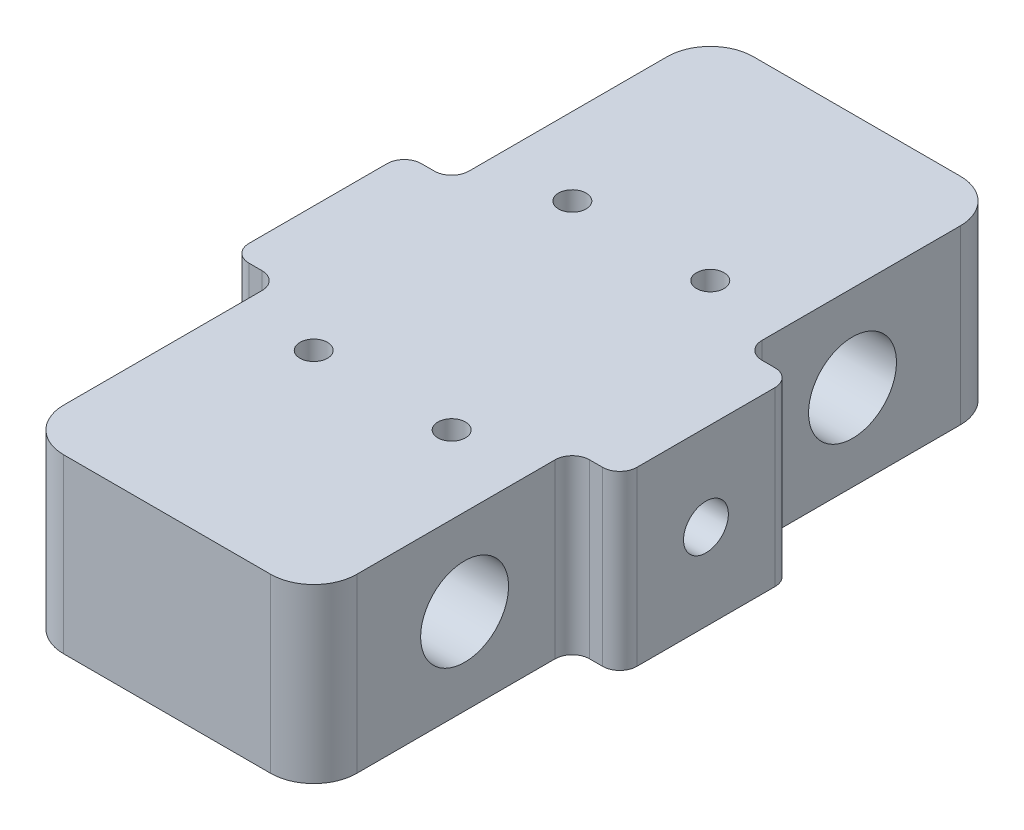
ISO-10303-21;
HEADER;
FILE_DESCRIPTION(('STEP AP214'),'2;1');
FILE_NAME('part.step','',(''),(''),'','','');
FILE_SCHEMA(('AUTOMOTIVE_DESIGN { 1 0 10303 214 1 1 1 1 }'));
ENDSEC;
DATA;
#1=APPLICATION_CONTEXT('core data for automotive mechanical design processes');
#2=APPLICATION_PROTOCOL_DEFINITION('international standard','automotive_design',2000,#1);
#3=PRODUCT_CONTEXT('',#1,'mechanical');
#4=PRODUCT('Part','Part','',(#3));
#5=PRODUCT_RELATED_PRODUCT_CATEGORY('part','',(#4));
#6=PRODUCT_DEFINITION_FORMATION('','',#4);
#7=PRODUCT_DEFINITION_CONTEXT('part definition',#1,'design');
#8=PRODUCT_DEFINITION('design','',#6,#7);
#9=PRODUCT_DEFINITION_SHAPE('','',#8);
#10=(LENGTH_UNIT() NAMED_UNIT(*) SI_UNIT(.MILLI.,.METRE.));
#11=(NAMED_UNIT(*) PLANE_ANGLE_UNIT() SI_UNIT($,.RADIAN.));
#12=(NAMED_UNIT(*) SI_UNIT($,.STERADIAN.) SOLID_ANGLE_UNIT());
#13=UNCERTAINTY_MEASURE_WITH_UNIT(LENGTH_MEASURE(1.E-05),#10,'distance_accuracy_value','');
#14=(GEOMETRIC_REPRESENTATION_CONTEXT(3) GLOBAL_UNCERTAINTY_ASSIGNED_CONTEXT((#13)) GLOBAL_UNIT_ASSIGNED_CONTEXT((#10,
#11,#12)) REPRESENTATION_CONTEXT('',''));
#15=CARTESIAN_POINT('',(0.,0.,0.));
#16=DIRECTION('',(0.,0.,1.));
#17=DIRECTION('',(1.,0.,0.));
#18=AXIS2_PLACEMENT_3D('',#15,#16,#17);
#19=CARTESIAN_POINT('',(0.,20.,0.));
#20=DIRECTION('',(0.,-1.,0.));
#21=DIRECTION('',(0.,0.,-1.));
#22=AXIS2_PLACEMENT_3D('',#19,#20,#21);
#23=PLANE('',#22);
#24=CARTESIAN_POINT('',(7.99999999999996,20.,-15.));
#25=DIRECTION('',(0.,1.,0.));
#26=DIRECTION('',(0.,0.,1.));
#27=AXIS2_PLACEMENT_3D('',#24,#25,#26);
#28=CIRCLE('',#27,1.6);
#29=CARTESIAN_POINT('',(7.99999999999996,20.,-13.4));
#30=VERTEX_POINT('',#29);
#31=EDGE_CURVE('E399',#30,#30,#28,.T.);
#32=ORIENTED_EDGE('',*,*,#31,.F.);
#33=EDGE_LOOP('',(#32));
#34=FACE_BOUND('',#33,.T.);
#35=CARTESIAN_POINT('',(-7.99999999999996,20.,-15.));
#36=DIRECTION('',(0.,1.,0.));
#37=DIRECTION('',(0.,0.,-1.));
#38=AXIS2_PLACEMENT_3D('',#35,#36,#37);
#39=CIRCLE('',#38,1.6);
#40=CARTESIAN_POINT('',(-7.99999999999996,20.,-16.6));
#41=VERTEX_POINT('',#40);
#42=EDGE_CURVE('E393',#41,#41,#39,.T.);
#43=ORIENTED_EDGE('',*,*,#42,.F.);
#44=EDGE_LOOP('',(#43));
#45=FACE_BOUND('',#44,.T.);
#46=CARTESIAN_POINT('',(-7.99999999999996,20.,15.));
#47=DIRECTION('',(0.,1.,0.));
#48=DIRECTION('',(0.,0.,1.));
#49=AXIS2_PLACEMENT_3D('',#46,#47,#48);
#50=CIRCLE('',#49,1.6);
#51=CARTESIAN_POINT('',(-7.99999999999996,20.,16.6));
#52=VERTEX_POINT('',#51);
#53=EDGE_CURVE('E387',#52,#52,#50,.T.);
#54=ORIENTED_EDGE('',*,*,#53,.F.);
#55=EDGE_LOOP('',(#54));
#56=FACE_BOUND('',#55,.T.);
#57=CARTESIAN_POINT('',(7.99999999999997,20.,15.));
#58=DIRECTION('',(0.,1.,0.));
#59=DIRECTION('',(0.,0.,-1.));
#60=AXIS2_PLACEMENT_3D('',#57,#58,#59);
#61=CIRCLE('',#60,1.6);
#62=CARTESIAN_POINT('',(7.99999999999997,20.,13.4));
#63=VERTEX_POINT('',#62);
#64=EDGE_CURVE('E381',#63,#63,#61,.T.);
#65=ORIENTED_EDGE('',*,*,#64,.F.);
#66=EDGE_LOOP('',(#65));
#67=FACE_BOUND('',#66,.T.);
#68=DIRECTION('',(0.,0.,1.));
#69=VECTOR('',#68,1.);
#70=CARTESIAN_POINT('',(17.,20.,-40.));
#71=LINE('',#70,#69);
#72=CARTESIAN_POINT('',(17.,20.,-35.));
#73=VERTEX_POINT('',#72);
#74=CARTESIAN_POINT('',(17.,20.,-12.));
#75=VERTEX_POINT('',#74);
#76=EDGE_CURVE('E783',#73,#75,#71,.T.);
#77=ORIENTED_EDGE('',*,*,#76,.F.);
#78=CARTESIAN_POINT('',(12.,20.,-35.));
#79=DIRECTION('',(0.,-1.,0.));
#80=DIRECTION('',(0.,0.,-1.));
#81=AXIS2_PLACEMENT_3D('',#78,#79,#80);
#82=CIRCLE('',#81,5.);
#83=CARTESIAN_POINT('',(12.,20.,-40.));
#84=VERTEX_POINT('',#83);
#85=EDGE_CURVE('E310',#73,#84,#82,.F.);
#86=ORIENTED_EDGE('',*,*,#85,.T.);
#87=DIRECTION('',(-1.,0.,0.));
#88=VECTOR('',#87,1.);
#89=CARTESIAN_POINT('',(-22.5,20.,-40.));
#90=LINE('',#89,#88);
#91=CARTESIAN_POINT('',(-12.,20.,-40.));
#92=VERTEX_POINT('',#91);
#93=EDGE_CURVE('E408',#84,#92,#90,.T.);
#94=ORIENTED_EDGE('',*,*,#93,.T.);
#95=CARTESIAN_POINT('',(-12.,20.,-35.));
#96=DIRECTION('',(0.,-1.,0.));
#97=DIRECTION('',(0.,0.,-1.));
#98=AXIS2_PLACEMENT_3D('',#95,#96,#97);
#99=CIRCLE('',#98,5.);
#100=CARTESIAN_POINT('',(-17.,20.,-35.));
#101=VERTEX_POINT('',#100);
#102=EDGE_CURVE('E308',#92,#101,#99,.F.);
#103=ORIENTED_EDGE('',*,*,#102,.T.);
#104=DIRECTION('',(0.,0.,1.));
#105=VECTOR('',#104,1.);
#106=CARTESIAN_POINT('',(-17.,20.,-40.));
#107=LINE('',#106,#105);
#108=CARTESIAN_POINT('',(-17.,20.,-12.));
#109=VERTEX_POINT('',#108);
#110=EDGE_CURVE('E777',#101,#109,#107,.T.);
#111=ORIENTED_EDGE('',*,*,#110,.T.);
#112=CARTESIAN_POINT('',(-19.,20.,-12.));
#113=DIRECTION('',(0.,-1.,0.));
#114=DIRECTION('',(0.,0.,-1.));
#115=AXIS2_PLACEMENT_3D('',#112,#113,#114);
#116=CIRCLE('',#115,2.);
#117=CARTESIAN_POINT('',(-19.,20.,-10.));
#118=VERTEX_POINT('',#117);
#119=EDGE_CURVE('E294',#109,#118,#116,.T.);
#120=ORIENTED_EDGE('',*,*,#119,.T.);
#121=DIRECTION('',(-1.,0.,0.));
#122=VECTOR('',#121,1.);
#123=CARTESIAN_POINT('',(-17.,20.,-10.));
#124=LINE('',#123,#122);
#125=CARTESIAN_POINT('',(-20.5,20.,-10.));
#126=VERTEX_POINT('',#125);
#127=EDGE_CURVE('E776',#118,#126,#124,.T.);
#128=ORIENTED_EDGE('',*,*,#127,.T.);
#129=CARTESIAN_POINT('',(-20.5,20.,-8.));
#130=DIRECTION('',(0.,-1.,0.));
#131=DIRECTION('',(0.,0.,-1.));
#132=AXIS2_PLACEMENT_3D('',#129,#130,#131);
#133=CIRCLE('',#132,2.);
#134=CARTESIAN_POINT('',(-22.5,20.,-8.));
#135=VERTEX_POINT('',#134);
#136=EDGE_CURVE('E251',#126,#135,#133,.F.);
#137=ORIENTED_EDGE('',*,*,#136,.T.);
#138=DIRECTION('',(0.,0.,1.));
#139=VECTOR('',#138,1.);
#140=CARTESIAN_POINT('',(-22.5,20.,40.));
#141=LINE('',#140,#139);
#142=CARTESIAN_POINT('',(-22.5,20.,8.));
#143=VERTEX_POINT('',#142);
#144=EDGE_CURVE('E231',#135,#143,#141,.T.);
#145=ORIENTED_EDGE('',*,*,#144,.T.);
#146=CARTESIAN_POINT('',(-20.5,20.,8.));
#147=DIRECTION('',(0.,-1.,0.));
#148=DIRECTION('',(0.,0.,-1.));
#149=AXIS2_PLACEMENT_3D('',#146,#147,#148);
#150=CIRCLE('',#149,2.);
#151=CARTESIAN_POINT('',(-20.5,20.,10.));
#152=VERTEX_POINT('',#151);
#153=EDGE_CURVE('E249',#143,#152,#150,.F.);
#154=ORIENTED_EDGE('',*,*,#153,.T.);
#155=DIRECTION('',(-1.,0.,0.));
#156=VECTOR('',#155,1.);
#157=CARTESIAN_POINT('',(-17.,20.,10.));
#158=LINE('',#157,#156);
#159=CARTESIAN_POINT('',(-19.,20.,10.));
#160=VERTEX_POINT('',#159);
#161=EDGE_CURVE('E362',#160,#152,#158,.T.);
#162=ORIENTED_EDGE('',*,*,#161,.F.);
#163=CARTESIAN_POINT('',(-19.,20.,12.));
#164=DIRECTION('',(0.,-1.,0.));
#165=DIRECTION('',(0.,0.,-1.));
#166=AXIS2_PLACEMENT_3D('',#163,#164,#165);
#167=CIRCLE('',#166,2.);
#168=CARTESIAN_POINT('',(-17.,20.,12.));
#169=VERTEX_POINT('',#168);
#170=EDGE_CURVE('E298',#160,#169,#167,.T.);
#171=ORIENTED_EDGE('',*,*,#170,.T.);
#172=DIRECTION('',(0.,0.,-1.));
#173=VECTOR('',#172,1.);
#174=CARTESIAN_POINT('',(-17.,20.,40.));
#175=LINE('',#174,#173);
#176=CARTESIAN_POINT('',(-17.,20.,35.));
#177=VERTEX_POINT('',#176);
#178=EDGE_CURVE('E354',#177,#169,#175,.T.);
#179=ORIENTED_EDGE('',*,*,#178,.F.);
#180=CARTESIAN_POINT('',(-12.,20.,35.));
#181=DIRECTION('',(0.,-1.,0.));
#182=DIRECTION('',(0.,0.,-1.));
#183=AXIS2_PLACEMENT_3D('',#180,#181,#182);
#184=CIRCLE('',#183,5.);
#185=CARTESIAN_POINT('',(-12.,20.,40.));
#186=VERTEX_POINT('',#185);
#187=EDGE_CURVE('E304',#177,#186,#184,.F.);
#188=ORIENTED_EDGE('',*,*,#187,.T.);
#189=DIRECTION('',(1.,0.,0.));
#190=VECTOR('',#189,1.);
#191=CARTESIAN_POINT('',(-22.5,20.,40.));
#192=LINE('',#191,#190);
#193=CARTESIAN_POINT('',(12.,20.,40.));
#194=VERTEX_POINT('',#193);
#195=EDGE_CURVE('E226',#186,#194,#192,.T.);
#196=ORIENTED_EDGE('',*,*,#195,.T.);
#197=CARTESIAN_POINT('',(12.,20.,35.));
#198=DIRECTION('',(0.,-1.,0.));
#199=DIRECTION('',(0.,0.,-1.));
#200=AXIS2_PLACEMENT_3D('',#197,#198,#199);
#201=CIRCLE('',#200,5.);
#202=CARTESIAN_POINT('',(17.,20.,35.));
#203=VERTEX_POINT('',#202);
#204=EDGE_CURVE('E306',#194,#203,#201,.F.);
#205=ORIENTED_EDGE('',*,*,#204,.T.);
#206=DIRECTION('',(0.,0.,-1.));
#207=VECTOR('',#206,1.);
#208=CARTESIAN_POINT('',(17.,20.,40.));
#209=LINE('',#208,#207);
#210=CARTESIAN_POINT('',(17.,20.,12.));
#211=VERTEX_POINT('',#210);
#212=EDGE_CURVE('E338',#203,#211,#209,.T.);
#213=ORIENTED_EDGE('',*,*,#212,.T.);
#214=CARTESIAN_POINT('',(19.,20.,12.));
#215=DIRECTION('',(0.,-1.,0.));
#216=DIRECTION('',(0.,0.,-1.));
#217=AXIS2_PLACEMENT_3D('',#214,#215,#216);
#218=CIRCLE('',#217,2.);
#219=CARTESIAN_POINT('',(19.,20.,10.));
#220=VERTEX_POINT('',#219);
#221=EDGE_CURVE('E290',#211,#220,#218,.T.);
#222=ORIENTED_EDGE('',*,*,#221,.T.);
#223=DIRECTION('',(1.,0.,0.));
#224=VECTOR('',#223,1.);
#225=CARTESIAN_POINT('',(17.,20.,10.));
#226=LINE('',#225,#224);
#227=CARTESIAN_POINT('',(20.5,20.,10.));
#228=VERTEX_POINT('',#227);
#229=EDGE_CURVE('E425',#220,#228,#226,.T.);
#230=ORIENTED_EDGE('',*,*,#229,.T.);
#231=CARTESIAN_POINT('',(20.5,20.,8.));
#232=DIRECTION('',(0.,-1.,0.));
#233=DIRECTION('',(0.,0.,-1.));
#234=AXIS2_PLACEMENT_3D('',#231,#232,#233);
#235=CIRCLE('',#234,2.);
#236=CARTESIAN_POINT('',(22.5,20.,8.));
#237=VERTEX_POINT('',#236);
#238=EDGE_CURVE('E253',#228,#237,#235,.F.);
#239=ORIENTED_EDGE('',*,*,#238,.T.);
#240=DIRECTION('',(0.,0.,-1.));
#241=VECTOR('',#240,1.);
#242=CARTESIAN_POINT('',(22.5,20.,40.));
#243=LINE('',#242,#241);
#244=CARTESIAN_POINT('',(22.5,20.,-8.));
#245=VERTEX_POINT('',#244);
#246=EDGE_CURVE('E405',#237,#245,#243,.T.);
#247=ORIENTED_EDGE('',*,*,#246,.T.);
#248=CARTESIAN_POINT('',(20.5,20.,-8.));
#249=DIRECTION('',(0.,-1.,0.));
#250=DIRECTION('',(0.,0.,-1.));
#251=AXIS2_PLACEMENT_3D('',#248,#249,#250);
#252=CIRCLE('',#251,2.);
#253=CARTESIAN_POINT('',(20.5,20.,-10.));
#254=VERTEX_POINT('',#253);
#255=EDGE_CURVE('E255',#245,#254,#252,.F.);
#256=ORIENTED_EDGE('',*,*,#255,.T.);
#257=DIRECTION('',(1.,0.,0.));
#258=VECTOR('',#257,1.);
#259=CARTESIAN_POINT('',(17.,20.,-10.));
#260=LINE('',#259,#258);
#261=CARTESIAN_POINT('',(19.,20.,-10.));
#262=VERTEX_POINT('',#261);
#263=EDGE_CURVE('E221',#262,#254,#260,.T.);
#264=ORIENTED_EDGE('',*,*,#263,.F.);
#265=CARTESIAN_POINT('',(19.,20.,-12.));
#266=DIRECTION('',(0.,-1.,0.));
#267=DIRECTION('',(0.,0.,-1.));
#268=AXIS2_PLACEMENT_3D('',#265,#266,#267);
#269=CIRCLE('',#268,2.);
#270=EDGE_CURVE('E209',#262,#75,#269,.T.);
#271=ORIENTED_EDGE('',*,*,#270,.T.);
#272=EDGE_LOOP('',(#77,#86,#94,#103,#111,#120,#128,#137,#145,#154,#162,#171,#179,#188,#196,#205,
#213,#222,#230,#239,#247,#256,#264,#271));
#273=FACE_BOUND('',#272,.T.);
#274=ADVANCED_FACE('F34',(#34,#45,#56,#67,#273),#23,.F.);
#275=CARTESIAN_POINT('',(0.,0.,0.));
#276=DIRECTION('',(0.,-1.,0.));
#277=DIRECTION('',(0.,0.,-1.));
#278=AXIS2_PLACEMENT_3D('',#275,#276,#277);
#279=PLANE('',#278);
#280=CARTESIAN_POINT('',(-7.99999999999996,0.,15.));
#281=DIRECTION('',(0.,1.,0.));
#282=DIRECTION('',(0.,0.,1.));
#283=AXIS2_PLACEMENT_3D('',#280,#281,#282);
#284=CIRCLE('',#283,1.6);
#285=CARTESIAN_POINT('',(-7.99999999999996,0.,16.6));
#286=VERTEX_POINT('',#285);
#287=EDGE_CURVE('E384',#286,#286,#284,.T.);
#288=ORIENTED_EDGE('',*,*,#287,.T.);
#289=EDGE_LOOP('',(#288));
#290=FACE_BOUND('',#289,.T.);
#291=CARTESIAN_POINT('',(7.99999999999996,0.,-15.));
#292=DIRECTION('',(0.,1.,0.));
#293=DIRECTION('',(0.,0.,1.));
#294=AXIS2_PLACEMENT_3D('',#291,#292,#293);
#295=CIRCLE('',#294,1.6);
#296=CARTESIAN_POINT('',(7.99999999999996,0.,-13.4));
#297=VERTEX_POINT('',#296);
#298=EDGE_CURVE('E396',#297,#297,#295,.T.);
#299=ORIENTED_EDGE('',*,*,#298,.T.);
#300=EDGE_LOOP('',(#299));
#301=FACE_BOUND('',#300,.T.);
#302=CARTESIAN_POINT('',(-7.99999999999996,0.,-15.));
#303=DIRECTION('',(0.,1.,0.));
#304=DIRECTION('',(0.,0.,-1.));
#305=AXIS2_PLACEMENT_3D('',#302,#303,#304);
#306=CIRCLE('',#305,1.6);
#307=CARTESIAN_POINT('',(-7.99999999999996,0.,-16.6));
#308=VERTEX_POINT('',#307);
#309=EDGE_CURVE('E390',#308,#308,#306,.T.);
#310=ORIENTED_EDGE('',*,*,#309,.T.);
#311=EDGE_LOOP('',(#310));
#312=FACE_BOUND('',#311,.T.);
#313=CARTESIAN_POINT('',(7.99999999999997,0.,15.));
#314=DIRECTION('',(0.,1.,0.));
#315=DIRECTION('',(0.,0.,-1.));
#316=AXIS2_PLACEMENT_3D('',#313,#314,#315);
#317=CIRCLE('',#316,1.6);
#318=CARTESIAN_POINT('',(7.99999999999997,0.,13.4));
#319=VERTEX_POINT('',#318);
#320=EDGE_CURVE('E377',#319,#319,#317,.T.);
#321=ORIENTED_EDGE('',*,*,#320,.T.);
#322=EDGE_LOOP('',(#321));
#323=FACE_BOUND('',#322,.T.);
#324=DIRECTION('',(-1.,0.,0.));
#325=VECTOR('',#324,1.);
#326=CARTESIAN_POINT('',(-22.5,0.,-40.));
#327=LINE('',#326,#325);
#328=CARTESIAN_POINT('',(12.,0.,-40.));
#329=VERTEX_POINT('',#328);
#330=CARTESIAN_POINT('',(-12.,0.,-40.));
#331=VERTEX_POINT('',#330);
#332=EDGE_CURVE('E415',#329,#331,#327,.T.);
#333=ORIENTED_EDGE('',*,*,#332,.F.);
#334=CARTESIAN_POINT('',(12.,0.,-35.));
#335=DIRECTION('',(0.,-1.,0.));
#336=DIRECTION('',(0.,0.,-1.));
#337=AXIS2_PLACEMENT_3D('',#334,#335,#336);
#338=CIRCLE('',#337,5.);
#339=CARTESIAN_POINT('',(17.,0.,-35.));
#340=VERTEX_POINT('',#339);
#341=EDGE_CURVE('E322',#329,#340,#338,.T.);
#342=ORIENTED_EDGE('',*,*,#341,.T.);
#343=DIRECTION('',(0.,0.,-1.));
#344=VECTOR('',#343,1.);
#345=CARTESIAN_POINT('',(17.,0.,-40.));
#346=LINE('',#345,#344);
#347=CARTESIAN_POINT('',(17.,0.,-12.));
#348=VERTEX_POINT('',#347);
#349=EDGE_CURVE('E204',#348,#340,#346,.T.);
#350=ORIENTED_EDGE('',*,*,#349,.F.);
#351=CARTESIAN_POINT('',(19.,0.,-12.));
#352=DIRECTION('',(0.,-1.,0.));
#353=DIRECTION('',(0.,0.,-1.));
#354=AXIS2_PLACEMENT_3D('',#351,#352,#353);
#355=CIRCLE('',#354,2.);
#356=CARTESIAN_POINT('',(19.,0.,-10.));
#357=VERTEX_POINT('',#356);
#358=EDGE_CURVE('E198',#348,#357,#355,.F.);
#359=ORIENTED_EDGE('',*,*,#358,.T.);
#360=DIRECTION('',(1.,0.,0.));
#361=VECTOR('',#360,1.);
#362=CARTESIAN_POINT('',(17.,0.,-10.));
#363=LINE('',#362,#361);
#364=CARTESIAN_POINT('',(20.5,0.,-10.));
#365=VERTEX_POINT('',#364);
#366=EDGE_CURVE('E202',#357,#365,#363,.T.);
#367=ORIENTED_EDGE('',*,*,#366,.T.);
#368=CARTESIAN_POINT('',(20.5,0.,-8.));
#369=DIRECTION('',(0.,-1.,0.));
#370=DIRECTION('',(0.,0.,-1.));
#371=AXIS2_PLACEMENT_3D('',#368,#369,#370);
#372=CIRCLE('',#371,2.);
#373=CARTESIAN_POINT('',(22.5,0.,-8.));
#374=VERTEX_POINT('',#373);
#375=EDGE_CURVE('E242',#365,#374,#372,.T.);
#376=ORIENTED_EDGE('',*,*,#375,.T.);
#377=DIRECTION('',(0.,0.,-1.));
#378=VECTOR('',#377,1.);
#379=CARTESIAN_POINT('',(22.5,0.,40.));
#380=LINE('',#379,#378);
#381=CARTESIAN_POINT('',(22.5,0.,8.));
#382=VERTEX_POINT('',#381);
#383=EDGE_CURVE('E402',#382,#374,#380,.T.);
#384=ORIENTED_EDGE('',*,*,#383,.F.);
#385=CARTESIAN_POINT('',(20.5,0.,8.));
#386=DIRECTION('',(0.,-1.,0.));
#387=DIRECTION('',(0.,0.,-1.));
#388=AXIS2_PLACEMENT_3D('',#385,#386,#387);
#389=CIRCLE('',#388,2.);
#390=CARTESIAN_POINT('',(20.5,0.,10.));
#391=VERTEX_POINT('',#390);
#392=EDGE_CURVE('E240',#382,#391,#389,.T.);
#393=ORIENTED_EDGE('',*,*,#392,.T.);
#394=DIRECTION('',(1.,0.,0.));
#395=VECTOR('',#394,1.);
#396=CARTESIAN_POINT('',(17.,0.,10.));
#397=LINE('',#396,#395);
#398=CARTESIAN_POINT('',(19.,0.,10.));
#399=VERTEX_POINT('',#398);
#400=EDGE_CURVE('E788',#399,#391,#397,.T.);
#401=ORIENTED_EDGE('',*,*,#400,.F.);
#402=CARTESIAN_POINT('',(19.,0.,12.));
#403=DIRECTION('',(0.,-1.,0.));
#404=DIRECTION('',(0.,0.,-1.));
#405=AXIS2_PLACEMENT_3D('',#402,#403,#404);
#406=CIRCLE('',#405,2.);
#407=CARTESIAN_POINT('',(17.,0.,12.));
#408=VERTEX_POINT('',#407);
#409=EDGE_CURVE('E288',#399,#408,#406,.F.);
#410=ORIENTED_EDGE('',*,*,#409,.T.);
#411=DIRECTION('',(0.,0.,1.));
#412=VECTOR('',#411,1.);
#413=CARTESIAN_POINT('',(17.,0.,40.));
#414=LINE('',#413,#412);
#415=CARTESIAN_POINT('',(17.,0.,35.));
#416=VERTEX_POINT('',#415);
#417=EDGE_CURVE('E336',#408,#416,#414,.T.);
#418=ORIENTED_EDGE('',*,*,#417,.T.);
#419=CARTESIAN_POINT('',(12.,0.,35.));
#420=DIRECTION('',(0.,-1.,0.));
#421=DIRECTION('',(0.,0.,-1.));
#422=AXIS2_PLACEMENT_3D('',#419,#420,#421);
#423=CIRCLE('',#422,5.);
#424=CARTESIAN_POINT('',(12.,0.,40.));
#425=VERTEX_POINT('',#424);
#426=EDGE_CURVE('E318',#416,#425,#423,.T.);
#427=ORIENTED_EDGE('',*,*,#426,.T.);
#428=DIRECTION('',(1.,0.,0.));
#429=VECTOR('',#428,1.);
#430=CARTESIAN_POINT('',(-22.5,0.,40.));
#431=LINE('',#430,#429);
#432=CARTESIAN_POINT('',(-12.,0.,40.));
#433=VERTEX_POINT('',#432);
#434=EDGE_CURVE('E350',#433,#425,#431,.T.);
#435=ORIENTED_EDGE('',*,*,#434,.F.);
#436=CARTESIAN_POINT('',(-12.,0.,35.));
#437=DIRECTION('',(0.,-1.,0.));
#438=DIRECTION('',(0.,0.,-1.));
#439=AXIS2_PLACEMENT_3D('',#436,#437,#438);
#440=CIRCLE('',#439,5.);
#441=CARTESIAN_POINT('',(-17.,0.,35.));
#442=VERTEX_POINT('',#441);
#443=EDGE_CURVE('E57',#433,#442,#440,.T.);
#444=ORIENTED_EDGE('',*,*,#443,.T.);
#445=DIRECTION('',(0.,0.,1.));
#446=VECTOR('',#445,1.);
#447=CARTESIAN_POINT('',(-17.,0.,40.));
#448=LINE('',#447,#446);
#449=CARTESIAN_POINT('',(-17.,0.,12.));
#450=VERTEX_POINT('',#449);
#451=EDGE_CURVE('E360',#450,#442,#448,.T.);
#452=ORIENTED_EDGE('',*,*,#451,.F.);
#453=CARTESIAN_POINT('',(-19.,0.,12.));
#454=DIRECTION('',(0.,-1.,0.));
#455=DIRECTION('',(0.,0.,-1.));
#456=AXIS2_PLACEMENT_3D('',#453,#454,#455);
#457=CIRCLE('',#456,2.);
#458=CARTESIAN_POINT('',(-19.,0.,10.));
#459=VERTEX_POINT('',#458);
#460=EDGE_CURVE('E296',#450,#459,#457,.F.);
#461=ORIENTED_EDGE('',*,*,#460,.T.);
#462=DIRECTION('',(-1.,0.,0.));
#463=VECTOR('',#462,1.);
#464=CARTESIAN_POINT('',(-17.,0.,10.));
#465=LINE('',#464,#463);
#466=CARTESIAN_POINT('',(-20.5,0.,10.));
#467=VERTEX_POINT('',#466);
#468=EDGE_CURVE('E365',#459,#467,#465,.T.);
#469=ORIENTED_EDGE('',*,*,#468,.T.);
#470=CARTESIAN_POINT('',(-20.5,0.,8.));
#471=DIRECTION('',(0.,-1.,0.));
#472=DIRECTION('',(0.,0.,-1.));
#473=AXIS2_PLACEMENT_3D('',#470,#471,#472);
#474=CIRCLE('',#473,2.);
#475=CARTESIAN_POINT('',(-22.5,0.,8.));
#476=VERTEX_POINT('',#475);
#477=EDGE_CURVE('E228',#467,#476,#474,.T.);
#478=ORIENTED_EDGE('',*,*,#477,.T.);
#479=DIRECTION('',(0.,0.,1.));
#480=VECTOR('',#479,1.);
#481=CARTESIAN_POINT('',(-22.5,0.,40.));
#482=LINE('',#481,#480);
#483=CARTESIAN_POINT('',(-22.5,0.,-8.));
#484=VERTEX_POINT('',#483);
#485=EDGE_CURVE('E418',#484,#476,#482,.T.);
#486=ORIENTED_EDGE('',*,*,#485,.F.);
#487=CARTESIAN_POINT('',(-20.5,0.,-8.));
#488=DIRECTION('',(0.,-1.,0.));
#489=DIRECTION('',(0.,0.,-1.));
#490=AXIS2_PLACEMENT_3D('',#487,#488,#489);
#491=CIRCLE('',#490,2.);
#492=CARTESIAN_POINT('',(-20.5,0.,-10.));
#493=VERTEX_POINT('',#492);
#494=EDGE_CURVE('E238',#484,#493,#491,.T.);
#495=ORIENTED_EDGE('',*,*,#494,.T.);
#496=DIRECTION('',(-1.,0.,0.));
#497=VECTOR('',#496,1.);
#498=CARTESIAN_POINT('',(-17.,0.,-10.));
#499=LINE('',#498,#497);
#500=CARTESIAN_POINT('',(-19.,0.,-10.));
#501=VERTEX_POINT('',#500);
#502=EDGE_CURVE('E772',#501,#493,#499,.T.);
#503=ORIENTED_EDGE('',*,*,#502,.F.);
#504=CARTESIAN_POINT('',(-19.,0.,-12.));
#505=DIRECTION('',(0.,-1.,0.));
#506=DIRECTION('',(0.,0.,-1.));
#507=AXIS2_PLACEMENT_3D('',#504,#505,#506);
#508=CIRCLE('',#507,2.);
#509=CARTESIAN_POINT('',(-17.,0.,-12.));
#510=VERTEX_POINT('',#509);
#511=EDGE_CURVE('E292',#501,#510,#508,.F.);
#512=ORIENTED_EDGE('',*,*,#511,.T.);
#513=DIRECTION('',(0.,0.,-1.));
#514=VECTOR('',#513,1.);
#515=CARTESIAN_POINT('',(-17.,0.,-40.));
#516=LINE('',#515,#514);
#517=CARTESIAN_POINT('',(-17.,0.,-35.));
#518=VERTEX_POINT('',#517);
#519=EDGE_CURVE('E780',#510,#518,#516,.T.);
#520=ORIENTED_EDGE('',*,*,#519,.T.);
#521=CARTESIAN_POINT('',(-12.,0.,-35.));
#522=DIRECTION('',(0.,-1.,0.));
#523=DIRECTION('',(0.,0.,-1.));
#524=AXIS2_PLACEMENT_3D('',#521,#522,#523);
#525=CIRCLE('',#524,5.);
#526=EDGE_CURVE('E320',#518,#331,#525,.T.);
#527=ORIENTED_EDGE('',*,*,#526,.T.);
#528=EDGE_LOOP('',(#333,#342,#350,#359,#367,#376,#384,#393,#401,#410,#418,#427,#435,#444,#452,
#461,#469,#478,#486,#495,#503,#512,#520,#527));
#529=FACE_BOUND('',#528,.T.);
#530=ADVANCED_FACE('F201',(#290,#301,#312,#323,#529),#279,.T.);
#531=CARTESIAN_POINT('',(-22.5,20.,40.));
#532=DIRECTION('',(1.,0.,0.));
#533=DIRECTION('',(0.,0.,-1.));
#534=AXIS2_PLACEMENT_3D('',#531,#532,#533);
#535=PLANE('',#534);
#536=CARTESIAN_POINT('',(-22.5,10.,0.));
#537=DIRECTION('',(-1.,0.,0.));
#538=DIRECTION('',(0.,0.,1.));
#539=AXIS2_PLACEMENT_3D('',#536,#537,#538);
#540=CIRCLE('',#539,2.6);
#541=CARTESIAN_POINT('',(-22.5,10.,2.6));
#542=VERTEX_POINT('',#541);
#543=EDGE_CURVE('E378',#542,#542,#540,.T.);
#544=ORIENTED_EDGE('',*,*,#543,.F.);
#545=EDGE_LOOP('',(#544));
#546=FACE_BOUND('',#545,.T.);
#547=ORIENTED_EDGE('',*,*,#144,.F.);
#548=DIRECTION('',(0.,-1.,0.));
#549=VECTOR('',#548,1.);
#550=CARTESIAN_POINT('',(-22.5,0.,-8.));
#551=LINE('',#550,#549);
#552=EDGE_CURVE('E277',#135,#484,#551,.T.);
#553=ORIENTED_EDGE('',*,*,#552,.T.);
#554=ORIENTED_EDGE('',*,*,#485,.T.);
#555=DIRECTION('',(0.,-1.,0.));
#556=VECTOR('',#555,1.);
#557=CARTESIAN_POINT('',(-22.5,20.,8.));
#558=LINE('',#557,#556);
#559=EDGE_CURVE('E275',#476,#143,#558,.F.);
#560=ORIENTED_EDGE('',*,*,#559,.T.);
#561=EDGE_LOOP('',(#547,#553,#554,#560));
#562=FACE_BOUND('',#561,.T.);
#563=ADVANCED_FACE('F451',(#546,#562),#535,.F.);
#564=CARTESIAN_POINT('',(22.5,20.,40.));
#565=DIRECTION('',(-1.,0.,0.));
#566=DIRECTION('',(0.,0.,1.));
#567=AXIS2_PLACEMENT_3D('',#564,#565,#566);
#568=PLANE('',#567);
#569=CARTESIAN_POINT('',(22.5,10.,0.));
#570=DIRECTION('',(-1.,0.,0.));
#571=DIRECTION('',(0.,0.,1.));
#572=AXIS2_PLACEMENT_3D('',#569,#570,#571);
#573=CIRCLE('',#572,2.6);
#574=CARTESIAN_POINT('',(22.5,10.,2.6));
#575=VERTEX_POINT('',#574);
#576=EDGE_CURVE('E374',#575,#575,#573,.T.);
#577=ORIENTED_EDGE('',*,*,#576,.T.);
#578=EDGE_LOOP('',(#577));
#579=FACE_BOUND('',#578,.T.);
#580=ORIENTED_EDGE('',*,*,#383,.T.);
#581=DIRECTION('',(0.,-1.,0.));
#582=VECTOR('',#581,1.);
#583=CARTESIAN_POINT('',(22.5,20.,-8.));
#584=LINE('',#583,#582);
#585=EDGE_CURVE('E247',#374,#245,#584,.F.);
#586=ORIENTED_EDGE('',*,*,#585,.T.);
#587=ORIENTED_EDGE('',*,*,#246,.F.);
#588=DIRECTION('',(0.,-1.,0.));
#589=VECTOR('',#588,1.);
#590=CARTESIAN_POINT('',(22.5,0.,8.));
#591=LINE('',#590,#589);
#592=EDGE_CURVE('E244',#237,#382,#591,.T.);
#593=ORIENTED_EDGE('',*,*,#592,.T.);
#594=EDGE_LOOP('',(#580,#586,#587,#593));
#595=FACE_BOUND('',#594,.T.);
#596=ADVANCED_FACE('F465',(#579,#595),#568,.F.);
#597=CARTESIAN_POINT('',(-22.5,20.,-40.));
#598=DIRECTION('',(0.,0.,1.));
#599=DIRECTION('',(1.,0.,0.));
#600=AXIS2_PLACEMENT_3D('',#597,#598,#599);
#601=PLANE('',#600);
#602=ORIENTED_EDGE('',*,*,#93,.F.);
#603=DIRECTION('',(0.,1.,0.));
#604=VECTOR('',#603,1.);
#605=CARTESIAN_POINT('',(12.,20.,-40.));
#606=LINE('',#605,#604);
#607=EDGE_CURVE('E315',#84,#329,#606,.F.);
#608=ORIENTED_EDGE('',*,*,#607,.T.);
#609=ORIENTED_EDGE('',*,*,#332,.T.);
#610=DIRECTION('',(0.,1.,0.));
#611=VECTOR('',#610,1.);
#612=CARTESIAN_POINT('',(-12.,20.,-40.));
#613=LINE('',#612,#611);
#614=EDGE_CURVE('E312',#331,#92,#613,.T.);
#615=ORIENTED_EDGE('',*,*,#614,.T.);
#616=EDGE_LOOP('',(#602,#608,#609,#615));
#617=FACE_BOUND('',#616,.T.);
#618=ADVANCED_FACE('F462',(#617),#601,.F.);
#619=CARTESIAN_POINT('',(-22.5,20.,40.));
#620=DIRECTION('',(0.,0.,-1.));
#621=DIRECTION('',(-1.,0.,0.));
#622=AXIS2_PLACEMENT_3D('',#619,#620,#621);
#623=PLANE('',#622);
#624=ORIENTED_EDGE('',*,*,#434,.T.);
#625=DIRECTION('',(0.,1.,0.));
#626=VECTOR('',#625,1.);
#627=CARTESIAN_POINT('',(12.,20.,40.));
#628=LINE('',#627,#626);
#629=EDGE_CURVE('E327',#425,#194,#628,.T.);
#630=ORIENTED_EDGE('',*,*,#629,.T.);
#631=ORIENTED_EDGE('',*,*,#195,.F.);
#632=DIRECTION('',(0.,1.,0.));
#633=VECTOR('',#632,1.);
#634=CARTESIAN_POINT('',(-12.,20.,40.));
#635=LINE('',#634,#633);
#636=EDGE_CURVE('E325',#186,#433,#635,.F.);
#637=ORIENTED_EDGE('',*,*,#636,.T.);
#638=EDGE_LOOP('',(#624,#630,#631,#637));
#639=FACE_BOUND('',#638,.T.);
#640=ADVANCED_FACE('F348',(#639),#623,.F.);
#641=CARTESIAN_POINT('',(7.99999999999996,20.,-15.));
#642=DIRECTION('',(0.,-1.,0.));
#643=DIRECTION('',(0.,0.,-1.));
#644=AXIS2_PLACEMENT_3D('',#641,#642,#643);
#645=CYLINDRICAL_SURFACE('',#644,1.6);
#646=ORIENTED_EDGE('',*,*,#31,.T.);
#647=EDGE_LOOP('',(#646));
#648=FACE_BOUND('',#647,.T.);
#649=ORIENTED_EDGE('',*,*,#298,.F.);
#650=EDGE_LOOP('',(#649));
#651=FACE_BOUND('',#650,.T.);
#652=ADVANCED_FACE('F457',(#648,#651),#645,.F.);
#653=CARTESIAN_POINT('',(-7.99999999999996,20.,-15.));
#654=DIRECTION('',(0.,-1.,0.));
#655=DIRECTION('',(0.,0.,-1.));
#656=AXIS2_PLACEMENT_3D('',#653,#654,#655);
#657=CYLINDRICAL_SURFACE('',#656,1.6);
#658=ORIENTED_EDGE('',*,*,#42,.T.);
#659=EDGE_LOOP('',(#658));
#660=FACE_BOUND('',#659,.T.);
#661=ORIENTED_EDGE('',*,*,#309,.F.);
#662=EDGE_LOOP('',(#661));
#663=FACE_BOUND('',#662,.T.);
#664=ADVANCED_FACE('F724',(#660,#663),#657,.F.);
#665=CARTESIAN_POINT('',(-7.99999999999996,20.,15.));
#666=DIRECTION('',(0.,-1.,0.));
#667=DIRECTION('',(0.,0.,-1.));
#668=AXIS2_PLACEMENT_3D('',#665,#666,#667);
#669=CYLINDRICAL_SURFACE('',#668,1.6);
#670=ORIENTED_EDGE('',*,*,#53,.T.);
#671=EDGE_LOOP('',(#670));
#672=FACE_BOUND('',#671,.T.);
#673=ORIENTED_EDGE('',*,*,#287,.F.);
#674=EDGE_LOOP('',(#673));
#675=FACE_BOUND('',#674,.T.);
#676=ADVANCED_FACE('F714',(#672,#675),#669,.F.);
#677=CARTESIAN_POINT('',(7.99999999999997,20.,15.));
#678=DIRECTION('',(0.,-1.,0.));
#679=DIRECTION('',(0.,0.,-1.));
#680=AXIS2_PLACEMENT_3D('',#677,#678,#679);
#681=CYLINDRICAL_SURFACE('',#680,1.6);
#682=ORIENTED_EDGE('',*,*,#64,.T.);
#683=EDGE_LOOP('',(#682));
#684=FACE_BOUND('',#683,.T.);
#685=ORIENTED_EDGE('',*,*,#320,.F.);
#686=EDGE_LOOP('',(#685));
#687=FACE_BOUND('',#686,.T.);
#688=ADVANCED_FACE('F704',(#684,#687),#681,.F.);
#689=CARTESIAN_POINT('',(22.5,10.,0.));
#690=DIRECTION('',(-1.,0.,0.));
#691=DIRECTION('',(0.,0.,1.));
#692=AXIS2_PLACEMENT_3D('',#689,#690,#691);
#693=CYLINDRICAL_SURFACE('',#692,2.6);
#694=ORIENTED_EDGE('',*,*,#576,.F.);
#695=EDGE_LOOP('',(#694));
#696=FACE_BOUND('',#695,.T.);
#697=ORIENTED_EDGE('',*,*,#543,.T.);
#698=EDGE_LOOP('',(#697));
#699=FACE_BOUND('',#698,.T.);
#700=ADVANCED_FACE('F687',(#696,#699),#693,.F.);
#701=CARTESIAN_POINT('',(22.5,10.,-22.5));
#702=DIRECTION('',(-1.,0.,0.));
#703=DIRECTION('',(0.,0.,1.));
#704=AXIS2_PLACEMENT_3D('',#701,#702,#703);
#705=CYLINDRICAL_SURFACE('',#704,5.1);
#706=CARTESIAN_POINT('',(-17.,10.,-22.5));
#707=DIRECTION('',(1.,0.,0.));
#708=DIRECTION('',(0.,0.,-1.));
#709=AXIS2_PLACEMENT_3D('',#706,#707,#708);
#710=CIRCLE('',#709,5.1);
#711=CARTESIAN_POINT('',(-17.,10.,-27.6));
#712=VERTEX_POINT('',#711);
#713=EDGE_CURVE('E234',#712,#712,#710,.F.);
#714=ORIENTED_EDGE('',*,*,#713,.T.);
#715=EDGE_LOOP('',(#714));
#716=FACE_BOUND('',#715,.T.);
#717=CARTESIAN_POINT('',(17.,10.,-22.5));
#718=DIRECTION('',(-1.,0.,0.));
#719=DIRECTION('',(0.,0.,1.));
#720=AXIS2_PLACEMENT_3D('',#717,#718,#719);
#721=CIRCLE('',#720,5.1);
#722=CARTESIAN_POINT('',(17.,10.,-17.4));
#723=VERTEX_POINT('',#722);
#724=EDGE_CURVE('E220',#723,#723,#721,.F.);
#725=ORIENTED_EDGE('',*,*,#724,.T.);
#726=EDGE_LOOP('',(#725));
#727=FACE_BOUND('',#726,.T.);
#728=ADVANCED_FACE('F429',(#716,#727),#705,.F.);
#729=CARTESIAN_POINT('',(22.5,10.,22.5));
#730=DIRECTION('',(-1.,0.,0.));
#731=DIRECTION('',(0.,0.,1.));
#732=AXIS2_PLACEMENT_3D('',#729,#730,#731);
#733=CYLINDRICAL_SURFACE('',#732,5.1);
#734=CARTESIAN_POINT('',(17.,10.,22.5));
#735=DIRECTION('',(-1.,0.,0.));
#736=DIRECTION('',(0.,0.,1.));
#737=AXIS2_PLACEMENT_3D('',#734,#735,#736);
#738=CIRCLE('',#737,5.1);
#739=CARTESIAN_POINT('',(17.,10.,27.6));
#740=VERTEX_POINT('',#739);
#741=EDGE_CURVE('E367',#740,#740,#738,.F.);
#742=ORIENTED_EDGE('',*,*,#741,.T.);
#743=EDGE_LOOP('',(#742));
#744=FACE_BOUND('',#743,.T.);
#745=CARTESIAN_POINT('',(-17.,10.,22.5));
#746=DIRECTION('',(1.,0.,0.));
#747=DIRECTION('',(0.,0.,-1.));
#748=AXIS2_PLACEMENT_3D('',#745,#746,#747);
#749=CIRCLE('',#748,5.1);
#750=CARTESIAN_POINT('',(-17.,10.,17.4));
#751=VERTEX_POINT('',#750);
#752=EDGE_CURVE('E372',#751,#751,#749,.F.);
#753=ORIENTED_EDGE('',*,*,#752,.T.);
#754=EDGE_LOOP('',(#753));
#755=FACE_BOUND('',#754,.T.);
#756=ADVANCED_FACE('F571',(#744,#755),#733,.F.);
#757=CARTESIAN_POINT('',(-17.,0.,0.));
#758=DIRECTION('',(1.,0.,0.));
#759=DIRECTION('',(0.,0.,-1.));
#760=AXIS2_PLACEMENT_3D('',#757,#758,#759);
#761=PLANE('',#760);
#762=ORIENTED_EDGE('',*,*,#451,.T.);
#763=DIRECTION('',(0.,1.,0.));
#764=VECTOR('',#763,1.);
#765=CARTESIAN_POINT('',(-17.,0.,35.));
#766=LINE('',#765,#764);
#767=EDGE_CURVE('E11',#442,#177,#766,.T.);
#768=ORIENTED_EDGE('',*,*,#767,.T.);
#769=ORIENTED_EDGE('',*,*,#178,.T.);
#770=DIRECTION('',(0.,-1.,0.));
#771=VECTOR('',#770,1.);
#772=CARTESIAN_POINT('',(-17.,0.,12.));
#773=LINE('',#772,#771);
#774=EDGE_CURVE('E210',#169,#450,#773,.T.);
#775=ORIENTED_EDGE('',*,*,#774,.T.);
#776=EDGE_LOOP('',(#762,#768,#769,#775));
#777=FACE_BOUND('',#776,.T.);
#778=ORIENTED_EDGE('',*,*,#752,.F.);
#779=EDGE_LOOP('',(#778));
#780=FACE_BOUND('',#779,.T.);
#781=ADVANCED_FACE('F358',(#777,#780),#761,.F.);
#782=CARTESIAN_POINT('',(-17.,20.,10.));
#783=DIRECTION('',(0.,0.,-1.));
#784=DIRECTION('',(0.,1.,0.));
#785=AXIS2_PLACEMENT_3D('',#782,#783,#784);
#786=PLANE('',#785);
#787=ORIENTED_EDGE('',*,*,#161,.T.);
#788=DIRECTION('',(0.,-1.,0.));
#789=VECTOR('',#788,1.);
#790=CARTESIAN_POINT('',(-20.5,20.,10.));
#791=LINE('',#790,#789);
#792=EDGE_CURVE('E282',#152,#467,#791,.T.);
#793=ORIENTED_EDGE('',*,*,#792,.T.);
#794=ORIENTED_EDGE('',*,*,#468,.F.);
#795=DIRECTION('',(0.,-1.,0.));
#796=VECTOR('',#795,1.);
#797=CARTESIAN_POINT('',(-19.,20.,10.));
#798=LINE('',#797,#796);
#799=EDGE_CURVE('E280',#459,#160,#798,.F.);
#800=ORIENTED_EDGE('',*,*,#799,.T.);
#801=EDGE_LOOP('',(#787,#793,#794,#800));
#802=FACE_BOUND('',#801,.T.);
#803=ADVANCED_FACE('F559',(#802),#786,.F.);
#804=CARTESIAN_POINT('',(17.,0.,0.));
#805=DIRECTION('',(-1.,0.,0.));
#806=DIRECTION('',(0.,0.,-1.));
#807=AXIS2_PLACEMENT_3D('',#804,#805,#806);
#808=PLANE('',#807);
#809=ORIENTED_EDGE('',*,*,#212,.F.);
#810=DIRECTION('',(0.,1.,0.));
#811=VECTOR('',#810,1.);
#812=CARTESIAN_POINT('',(17.,0.,35.));
#813=LINE('',#812,#811);
#814=EDGE_CURVE('E42',#203,#416,#813,.F.);
#815=ORIENTED_EDGE('',*,*,#814,.T.);
#816=ORIENTED_EDGE('',*,*,#417,.F.);
#817=DIRECTION('',(0.,-1.,0.));
#818=VECTOR('',#817,1.);
#819=CARTESIAN_POINT('',(17.,0.,12.));
#820=LINE('',#819,#818);
#821=EDGE_CURVE('E264',#408,#211,#820,.F.);
#822=ORIENTED_EDGE('',*,*,#821,.T.);
#823=EDGE_LOOP('',(#809,#815,#816,#822));
#824=FACE_BOUND('',#823,.T.);
#825=ORIENTED_EDGE('',*,*,#741,.F.);
#826=EDGE_LOOP('',(#825));
#827=FACE_BOUND('',#826,.T.);
#828=ADVANCED_FACE('F334',(#824,#827),#808,.F.);
#829=CARTESIAN_POINT('',(17.,20.,10.));
#830=DIRECTION('',(0.,0.,1.));
#831=DIRECTION('',(0.,-1.,0.));
#832=AXIS2_PLACEMENT_3D('',#829,#830,#831);
#833=PLANE('',#832);
#834=ORIENTED_EDGE('',*,*,#400,.T.);
#835=DIRECTION('',(0.,-1.,0.));
#836=VECTOR('',#835,1.);
#837=CARTESIAN_POINT('',(20.5,20.,10.));
#838=LINE('',#837,#836);
#839=EDGE_CURVE('E262',#391,#228,#838,.F.);
#840=ORIENTED_EDGE('',*,*,#839,.T.);
#841=ORIENTED_EDGE('',*,*,#229,.F.);
#842=DIRECTION('',(0.,-1.,0.));
#843=VECTOR('',#842,1.);
#844=CARTESIAN_POINT('',(19.,20.,10.));
#845=LINE('',#844,#843);
#846=EDGE_CURVE('E259',#220,#399,#845,.T.);
#847=ORIENTED_EDGE('',*,*,#846,.T.);
#848=EDGE_LOOP('',(#834,#840,#841,#847));
#849=FACE_BOUND('',#848,.T.);
#850=ADVANCED_FACE('F433',(#849),#833,.T.);
#851=CARTESIAN_POINT('',(17.,0.,0.));
#852=DIRECTION('',(-1.,0.,0.));
#853=DIRECTION('',(0.,0.,1.));
#854=AXIS2_PLACEMENT_3D('',#851,#852,#853);
#855=PLANE('',#854);
#856=ORIENTED_EDGE('',*,*,#349,.T.);
#857=DIRECTION('',(0.,1.,0.));
#858=VECTOR('',#857,1.);
#859=CARTESIAN_POINT('',(17.,0.,-35.));
#860=LINE('',#859,#858);
#861=EDGE_CURVE('E301',#340,#73,#860,.T.);
#862=ORIENTED_EDGE('',*,*,#861,.T.);
#863=ORIENTED_EDGE('',*,*,#76,.T.);
#864=DIRECTION('',(0.,-1.,0.));
#865=VECTOR('',#864,1.);
#866=CARTESIAN_POINT('',(17.,0.,-12.));
#867=LINE('',#866,#865);
#868=EDGE_CURVE('E257',#75,#348,#867,.T.);
#869=ORIENTED_EDGE('',*,*,#868,.T.);
#870=EDGE_LOOP('',(#856,#862,#863,#869));
#871=FACE_BOUND('',#870,.T.);
#872=ORIENTED_EDGE('',*,*,#724,.F.);
#873=EDGE_LOOP('',(#872));
#874=FACE_BOUND('',#873,.T.);
#875=ADVANCED_FACE('F431',(#871,#874),#855,.F.);
#876=CARTESIAN_POINT('',(17.,20.,-10.));
#877=DIRECTION('',(0.,0.,1.));
#878=DIRECTION('',(0.,-1.,0.));
#879=AXIS2_PLACEMENT_3D('',#876,#877,#878);
#880=PLANE('',#879);
#881=ORIENTED_EDGE('',*,*,#263,.T.);
#882=DIRECTION('',(0.,-1.,0.));
#883=VECTOR('',#882,1.);
#884=CARTESIAN_POINT('',(20.5,20.,-10.));
#885=LINE('',#884,#883);
#886=EDGE_CURVE('E219',#254,#365,#885,.T.);
#887=ORIENTED_EDGE('',*,*,#886,.T.);
#888=ORIENTED_EDGE('',*,*,#366,.F.);
#889=DIRECTION('',(0.,-1.,0.));
#890=VECTOR('',#889,1.);
#891=CARTESIAN_POINT('',(19.,20.,-10.));
#892=LINE('',#891,#890);
#893=EDGE_CURVE('E216',#357,#262,#892,.F.);
#894=ORIENTED_EDGE('',*,*,#893,.T.);
#895=EDGE_LOOP('',(#881,#887,#888,#894));
#896=FACE_BOUND('',#895,.T.);
#897=ADVANCED_FACE('F215',(#896),#880,.F.);
#898=CARTESIAN_POINT('',(-17.,0.,0.));
#899=DIRECTION('',(1.,0.,0.));
#900=DIRECTION('',(0.,0.,1.));
#901=AXIS2_PLACEMENT_3D('',#898,#899,#900);
#902=PLANE('',#901);
#903=ORIENTED_EDGE('',*,*,#110,.F.);
#904=DIRECTION('',(0.,1.,0.));
#905=VECTOR('',#904,1.);
#906=CARTESIAN_POINT('',(-17.,0.,-35.));
#907=LINE('',#906,#905);
#908=EDGE_CURVE('E49',#101,#518,#907,.F.);
#909=ORIENTED_EDGE('',*,*,#908,.T.);
#910=ORIENTED_EDGE('',*,*,#519,.F.);
#911=DIRECTION('',(0.,-1.,0.));
#912=VECTOR('',#911,1.);
#913=CARTESIAN_POINT('',(-17.,0.,-12.));
#914=LINE('',#913,#912);
#915=EDGE_CURVE('E272',#510,#109,#914,.F.);
#916=ORIENTED_EDGE('',*,*,#915,.T.);
#917=EDGE_LOOP('',(#903,#909,#910,#916));
#918=FACE_BOUND('',#917,.T.);
#919=ORIENTED_EDGE('',*,*,#713,.F.);
#920=EDGE_LOOP('',(#919));
#921=FACE_BOUND('',#920,.T.);
#922=ADVANCED_FACE('F440',(#918,#921),#902,.F.);
#923=CARTESIAN_POINT('',(-17.,20.,-10.));
#924=DIRECTION('',(0.,0.,-1.));
#925=DIRECTION('',(0.,1.,0.));
#926=AXIS2_PLACEMENT_3D('',#923,#924,#925);
#927=PLANE('',#926);
#928=ORIENTED_EDGE('',*,*,#127,.F.);
#929=DIRECTION('',(0.,-1.,0.));
#930=VECTOR('',#929,1.);
#931=CARTESIAN_POINT('',(-19.,20.,-10.));
#932=LINE('',#931,#930);
#933=EDGE_CURVE('E269',#118,#501,#932,.T.);
#934=ORIENTED_EDGE('',*,*,#933,.T.);
#935=ORIENTED_EDGE('',*,*,#502,.T.);
#936=DIRECTION('',(0.,-1.,0.));
#937=VECTOR('',#936,1.);
#938=CARTESIAN_POINT('',(-20.5,20.,-10.));
#939=LINE('',#938,#937);
#940=EDGE_CURVE('E267',#493,#126,#939,.F.);
#941=ORIENTED_EDGE('',*,*,#940,.T.);
#942=EDGE_LOOP('',(#928,#934,#935,#941));
#943=FACE_BOUND('',#942,.T.);
#944=ADVANCED_FACE('F476',(#943),#927,.T.);
#945=CARTESIAN_POINT('',(20.5,20.,-8.));
#946=DIRECTION('',(0.,-1.,0.));
#947=DIRECTION('',(0.,0.,-1.));
#948=AXIS2_PLACEMENT_3D('',#945,#946,#947);
#949=CYLINDRICAL_SURFACE('',#948,2.);
#950=ORIENTED_EDGE('',*,*,#255,.F.);
#951=ORIENTED_EDGE('',*,*,#585,.F.);
#952=ORIENTED_EDGE('',*,*,#375,.F.);
#953=ORIENTED_EDGE('',*,*,#886,.F.);
#954=EDGE_LOOP('',(#950,#951,#952,#953));
#955=FACE_BOUND('',#954,.T.);
#956=ADVANCED_FACE('F473',(#955),#949,.T.);
#957=CARTESIAN_POINT('',(19.,0.,-12.));
#958=DIRECTION('',(0.,1.,0.));
#959=DIRECTION('',(0.,0.,1.));
#960=AXIS2_PLACEMENT_3D('',#957,#958,#959);
#961=CYLINDRICAL_SURFACE('',#960,2.);
#962=ORIENTED_EDGE('',*,*,#270,.F.);
#963=ORIENTED_EDGE('',*,*,#893,.F.);
#964=ORIENTED_EDGE('',*,*,#358,.F.);
#965=ORIENTED_EDGE('',*,*,#868,.F.);
#966=EDGE_LOOP('',(#962,#963,#964,#965));
#967=FACE_BOUND('',#966,.T.);
#968=ADVANCED_FACE('F224',(#967),#961,.F.);
#969=CARTESIAN_POINT('',(20.5,20.,8.));
#970=DIRECTION('',(0.,1.,0.));
#971=DIRECTION('',(0.,0.,1.));
#972=AXIS2_PLACEMENT_3D('',#969,#970,#971);
#973=CYLINDRICAL_SURFACE('',#972,2.);
#974=ORIENTED_EDGE('',*,*,#238,.F.);
#975=ORIENTED_EDGE('',*,*,#839,.F.);
#976=ORIENTED_EDGE('',*,*,#392,.F.);
#977=ORIENTED_EDGE('',*,*,#592,.F.);
#978=EDGE_LOOP('',(#974,#975,#976,#977));
#979=FACE_BOUND('',#978,.T.);
#980=ADVANCED_FACE('F480',(#979),#973,.T.);
#981=CARTESIAN_POINT('',(19.,20.,12.));
#982=DIRECTION('',(0.,-1.,0.));
#983=DIRECTION('',(0.,0.,-1.));
#984=AXIS2_PLACEMENT_3D('',#981,#982,#983);
#985=CYLINDRICAL_SURFACE('',#984,2.);
#986=ORIENTED_EDGE('',*,*,#221,.F.);
#987=ORIENTED_EDGE('',*,*,#821,.F.);
#988=ORIENTED_EDGE('',*,*,#409,.F.);
#989=ORIENTED_EDGE('',*,*,#846,.F.);
#990=EDGE_LOOP('',(#986,#987,#988,#989));
#991=FACE_BOUND('',#990,.T.);
#992=ADVANCED_FACE('F483',(#991),#985,.F.);
#993=CARTESIAN_POINT('',(-19.,20.,-12.));
#994=DIRECTION('',(0.,-1.,0.));
#995=DIRECTION('',(0.,0.,-1.));
#996=AXIS2_PLACEMENT_3D('',#993,#994,#995);
#997=CYLINDRICAL_SURFACE('',#996,2.);
#998=ORIENTED_EDGE('',*,*,#119,.F.);
#999=ORIENTED_EDGE('',*,*,#915,.F.);
#1000=ORIENTED_EDGE('',*,*,#511,.F.);
#1001=ORIENTED_EDGE('',*,*,#933,.F.);
#1002=EDGE_LOOP('',(#998,#999,#1000,#1001));
#1003=FACE_BOUND('',#1002,.T.);
#1004=ADVANCED_FACE('F487',(#1003),#997,.F.);
#1005=CARTESIAN_POINT('',(-20.5,20.,-8.));
#1006=DIRECTION('',(0.,1.,0.));
#1007=DIRECTION('',(0.,0.,1.));
#1008=AXIS2_PLACEMENT_3D('',#1005,#1006,#1007);
#1009=CYLINDRICAL_SURFACE('',#1008,2.);
#1010=ORIENTED_EDGE('',*,*,#136,.F.);
#1011=ORIENTED_EDGE('',*,*,#940,.F.);
#1012=ORIENTED_EDGE('',*,*,#494,.F.);
#1013=ORIENTED_EDGE('',*,*,#552,.F.);
#1014=EDGE_LOOP('',(#1010,#1011,#1012,#1013));
#1015=FACE_BOUND('',#1014,.T.);
#1016=ADVANCED_FACE('F491',(#1015),#1009,.T.);
#1017=CARTESIAN_POINT('',(-20.5,20.,8.));
#1018=DIRECTION('',(0.,-1.,0.));
#1019=DIRECTION('',(0.,0.,-1.));
#1020=AXIS2_PLACEMENT_3D('',#1017,#1018,#1019);
#1021=CYLINDRICAL_SURFACE('',#1020,2.);
#1022=ORIENTED_EDGE('',*,*,#153,.F.);
#1023=ORIENTED_EDGE('',*,*,#559,.F.);
#1024=ORIENTED_EDGE('',*,*,#477,.F.);
#1025=ORIENTED_EDGE('',*,*,#792,.F.);
#1026=EDGE_LOOP('',(#1022,#1023,#1024,#1025));
#1027=FACE_BOUND('',#1026,.T.);
#1028=ADVANCED_FACE('F495',(#1027),#1021,.T.);
#1029=CARTESIAN_POINT('',(-19.,0.,12.));
#1030=DIRECTION('',(0.,1.,0.));
#1031=DIRECTION('',(0.,0.,1.));
#1032=AXIS2_PLACEMENT_3D('',#1029,#1030,#1031);
#1033=CYLINDRICAL_SURFACE('',#1032,2.);
#1034=ORIENTED_EDGE('',*,*,#170,.F.);
#1035=ORIENTED_EDGE('',*,*,#799,.F.);
#1036=ORIENTED_EDGE('',*,*,#460,.F.);
#1037=ORIENTED_EDGE('',*,*,#774,.F.);
#1038=EDGE_LOOP('',(#1034,#1035,#1036,#1037));
#1039=FACE_BOUND('',#1038,.T.);
#1040=ADVANCED_FACE('F499',(#1039),#1033,.F.);
#1041=CARTESIAN_POINT('',(12.,0.,-35.));
#1042=DIRECTION('',(0.,1.,0.));
#1043=DIRECTION('',(0.,0.,1.));
#1044=AXIS2_PLACEMENT_3D('',#1041,#1042,#1043);
#1045=CYLINDRICAL_SURFACE('',#1044,5.);
#1046=ORIENTED_EDGE('',*,*,#341,.F.);
#1047=ORIENTED_EDGE('',*,*,#607,.F.);
#1048=ORIENTED_EDGE('',*,*,#85,.F.);
#1049=ORIENTED_EDGE('',*,*,#861,.F.);
#1050=EDGE_LOOP('',(#1046,#1047,#1048,#1049));
#1051=FACE_BOUND('',#1050,.T.);
#1052=ADVANCED_FACE('F503',(#1051),#1045,.T.);
#1053=CARTESIAN_POINT('',(-12.,20.,-35.));
#1054=DIRECTION('',(0.,1.,0.));
#1055=DIRECTION('',(0.,0.,1.));
#1056=AXIS2_PLACEMENT_3D('',#1053,#1054,#1055);
#1057=CYLINDRICAL_SURFACE('',#1056,5.);
#1058=ORIENTED_EDGE('',*,*,#526,.F.);
#1059=ORIENTED_EDGE('',*,*,#908,.F.);
#1060=ORIENTED_EDGE('',*,*,#102,.F.);
#1061=ORIENTED_EDGE('',*,*,#614,.F.);
#1062=EDGE_LOOP('',(#1058,#1059,#1060,#1061));
#1063=FACE_BOUND('',#1062,.T.);
#1064=ADVANCED_FACE('F507',(#1063),#1057,.T.);
#1065=CARTESIAN_POINT('',(12.,20.,35.));
#1066=DIRECTION('',(0.,1.,0.));
#1067=DIRECTION('',(0.,0.,1.));
#1068=AXIS2_PLACEMENT_3D('',#1065,#1066,#1067);
#1069=CYLINDRICAL_SURFACE('',#1068,5.);
#1070=ORIENTED_EDGE('',*,*,#426,.F.);
#1071=ORIENTED_EDGE('',*,*,#814,.F.);
#1072=ORIENTED_EDGE('',*,*,#204,.F.);
#1073=ORIENTED_EDGE('',*,*,#629,.F.);
#1074=EDGE_LOOP('',(#1070,#1071,#1072,#1073));
#1075=FACE_BOUND('',#1074,.T.);
#1076=ADVANCED_FACE('F345',(#1075),#1069,.T.);
#1077=CARTESIAN_POINT('',(-12.,0.,35.));
#1078=DIRECTION('',(0.,1.,0.));
#1079=DIRECTION('',(0.,0.,1.));
#1080=AXIS2_PLACEMENT_3D('',#1077,#1078,#1079);
#1081=CYLINDRICAL_SURFACE('',#1080,5.);
#1082=ORIENTED_EDGE('',*,*,#443,.F.);
#1083=ORIENTED_EDGE('',*,*,#636,.F.);
#1084=ORIENTED_EDGE('',*,*,#187,.F.);
#1085=ORIENTED_EDGE('',*,*,#767,.F.);
#1086=EDGE_LOOP('',(#1082,#1083,#1084,#1085));
#1087=FACE_BOUND('',#1086,.T.);
#1088=ADVANCED_FACE('F36',(#1087),#1081,.T.);
#1089=CLOSED_SHELL('',(#274,#530,#563,#596,#618,#640,#652,#664,#676,#688,#700,#728,#756,#781,
#803,#828,#850,#875,#897,#922,#944,#956,#968,#980,#992,#1004,#1016,#1028,#1040,#1052,#1064,
#1076,#1088));
#1090=MANIFOLD_SOLID_BREP('B2',#1089);
#1091=ADVANCED_BREP_SHAPE_REPRESENTATION('',(#18,#1090),#14);
#1092=SHAPE_DEFINITION_REPRESENTATION(#9,#1091);
ENDSEC;
END-ISO-10303-21;
